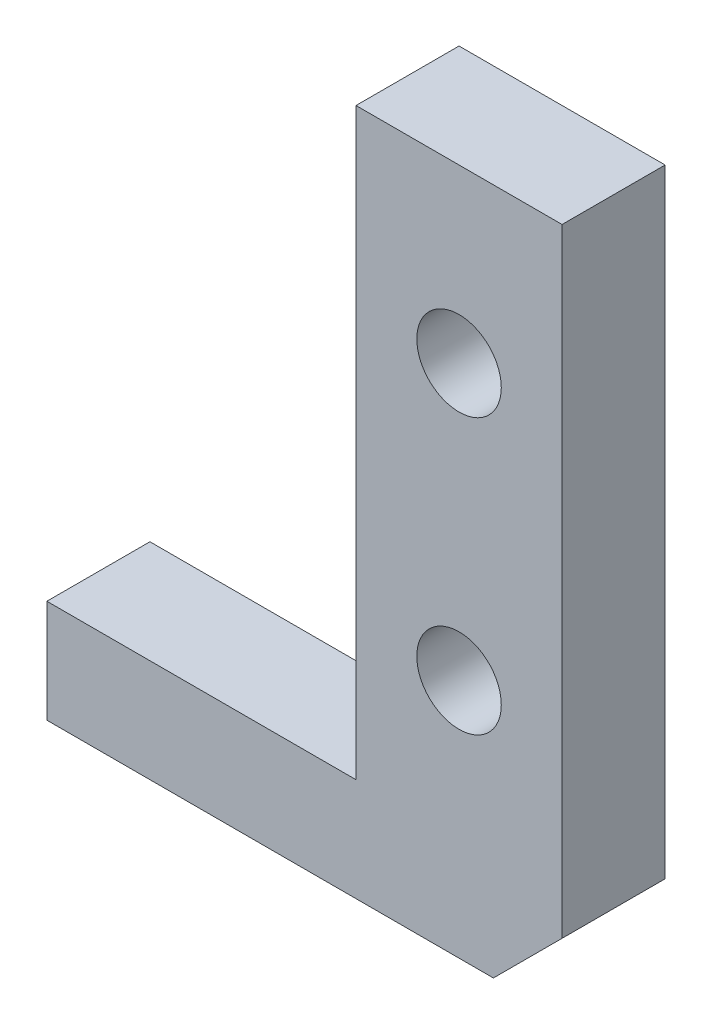
ISO-10303-21;
HEADER;
FILE_DESCRIPTION(('STEP AP214'),'2;1');
FILE_NAME('part.step','',(''),(''),'','','');
FILE_SCHEMA(('AUTOMOTIVE_DESIGN { 1 0 10303 214 1 1 1 1 }'));
ENDSEC;
DATA;
#1=APPLICATION_CONTEXT('core data for automotive mechanical design processes');
#2=APPLICATION_PROTOCOL_DEFINITION('international standard','automotive_design',2000,#1);
#3=PRODUCT_CONTEXT('',#1,'mechanical');
#4=PRODUCT('Part','Part','',(#3));
#5=PRODUCT_RELATED_PRODUCT_CATEGORY('part','',(#4));
#6=PRODUCT_DEFINITION_FORMATION('','',#4);
#7=PRODUCT_DEFINITION_CONTEXT('part definition',#1,'design');
#8=PRODUCT_DEFINITION('design','',#6,#7);
#9=PRODUCT_DEFINITION_SHAPE('','',#8);
#10=(LENGTH_UNIT() NAMED_UNIT(*) SI_UNIT(.MILLI.,.METRE.));
#11=(NAMED_UNIT(*) PLANE_ANGLE_UNIT() SI_UNIT($,.RADIAN.));
#12=(NAMED_UNIT(*) SI_UNIT($,.STERADIAN.) SOLID_ANGLE_UNIT());
#13=UNCERTAINTY_MEASURE_WITH_UNIT(LENGTH_MEASURE(1.E-05),#10,'distance_accuracy_value','');
#14=(GEOMETRIC_REPRESENTATION_CONTEXT(3) GLOBAL_UNCERTAINTY_ASSIGNED_CONTEXT((#13)) GLOBAL_UNIT_ASSIGNED_CONTEXT((#10,
#11,#12)) REPRESENTATION_CONTEXT('',''));
#15=CARTESIAN_POINT('',(0.,0.,0.));
#16=DIRECTION('',(0.,0.,1.));
#17=DIRECTION('',(1.,0.,0.));
#18=AXIS2_PLACEMENT_3D('',#15,#16,#17);
#19=CARTESIAN_POINT('',(0.,3.,3.));
#20=DIRECTION('',(1.,0.,0.));
#21=DIRECTION('',(0.,1.,0.));
#22=AXIS2_PLACEMENT_3D('',#19,#20,#21);
#23=PLANE('',#22);
#24=DIRECTION('',(0.,-1.,0.));
#25=VECTOR('',#24,1.);
#26=CARTESIAN_POINT('',(0.,3.,0.));
#27=LINE('',#26,#25);
#28=CARTESIAN_POINT('',(0.,3.,0.));
#29=VERTEX_POINT('',#28);
#30=CARTESIAN_POINT('',(0.,0.,0.));
#31=VERTEX_POINT('',#30);
#32=EDGE_CURVE('E123',#29,#31,#27,.T.);
#33=ORIENTED_EDGE('',*,*,#32,.T.);
#34=DIRECTION('',(0.,0.,-1.));
#35=VECTOR('',#34,1.);
#36=CARTESIAN_POINT('',(0.,0.,3.));
#37=LINE('',#36,#35);
#38=CARTESIAN_POINT('',(0.,0.,3.));
#39=VERTEX_POINT('',#38);
#40=EDGE_CURVE('E11',#39,#31,#37,.T.);
#41=ORIENTED_EDGE('',*,*,#40,.F.);
#42=DIRECTION('',(0.,-1.,0.));
#43=VECTOR('',#42,1.);
#44=CARTESIAN_POINT('',(0.,3.,3.));
#45=LINE('',#44,#43);
#46=CARTESIAN_POINT('',(0.,3.,3.));
#47=VERTEX_POINT('',#46);
#48=EDGE_CURVE('E136',#47,#39,#45,.T.);
#49=ORIENTED_EDGE('',*,*,#48,.F.);
#50=DIRECTION('',(0.,0.,-1.));
#51=VECTOR('',#50,1.);
#52=CARTESIAN_POINT('',(0.,3.,3.));
#53=LINE('',#52,#51);
#54=EDGE_CURVE('E119',#47,#29,#53,.T.);
#55=ORIENTED_EDGE('',*,*,#54,.T.);
#56=EDGE_LOOP('',(#33,#41,#49,#55));
#57=FACE_BOUND('',#56,.T.);
#58=ADVANCED_FACE('F33',(#57),#23,.F.);
#59=CARTESIAN_POINT('',(0.,0.,3.));
#60=DIRECTION('',(0.,1.,0.));
#61=DIRECTION('',(-1.,0.,0.));
#62=AXIS2_PLACEMENT_3D('',#59,#60,#61);
#63=PLANE('',#62);
#64=DIRECTION('',(1.,0.,0.));
#65=VECTOR('',#64,1.);
#66=CARTESIAN_POINT('',(0.,0.,0.));
#67=LINE('',#66,#65);
#68=CARTESIAN_POINT('',(13.,0.,0.));
#69=VERTEX_POINT('',#68);
#70=EDGE_CURVE('E126',#31,#69,#67,.T.);
#71=ORIENTED_EDGE('',*,*,#70,.T.);
#72=DIRECTION('',(0.,0.,-1.));
#73=VECTOR('',#72,1.);
#74=CARTESIAN_POINT('',(13.,0.,3.));
#75=LINE('',#74,#73);
#76=CARTESIAN_POINT('',(13.,0.,3.));
#77=VERTEX_POINT('',#76);
#78=EDGE_CURVE('E41',#77,#69,#75,.T.);
#79=ORIENTED_EDGE('',*,*,#78,.F.);
#80=DIRECTION('',(1.,0.,0.));
#81=VECTOR('',#80,1.);
#82=CARTESIAN_POINT('',(0.,0.,3.));
#83=LINE('',#82,#81);
#84=EDGE_CURVE('E89',#39,#77,#83,.T.);
#85=ORIENTED_EDGE('',*,*,#84,.F.);
#86=ORIENTED_EDGE('',*,*,#40,.T.);
#87=EDGE_LOOP('',(#71,#79,#85,#86));
#88=FACE_BOUND('',#87,.T.);
#89=ADVANCED_FACE('F195',(#88),#63,.F.);
#90=CARTESIAN_POINT('',(13.,0.,3.));
#91=DIRECTION('',(-0.707106781186549,0.707106781186546,0.));
#92=DIRECTION('',(-0.707106781186546,-0.707106781186549,0.));
#93=AXIS2_PLACEMENT_3D('',#90,#91,#92);
#94=PLANE('',#93);
#95=DIRECTION('',(0.707106781186546,0.707106781186549,0.));
#96=VECTOR('',#95,1.);
#97=CARTESIAN_POINT('',(13.,0.,0.));
#98=LINE('',#97,#96);
#99=CARTESIAN_POINT('',(15.,2.00000000000001,0.));
#100=VERTEX_POINT('',#99);
#101=EDGE_CURVE('E129',#69,#100,#98,.T.);
#102=ORIENTED_EDGE('',*,*,#101,.T.);
#103=DIRECTION('',(0.,0.,-1.));
#104=VECTOR('',#103,1.);
#105=CARTESIAN_POINT('',(15.,2.00000000000001,3.));
#106=LINE('',#105,#104);
#107=CARTESIAN_POINT('',(15.,2.00000000000001,3.));
#108=VERTEX_POINT('',#107);
#109=EDGE_CURVE('E140',#108,#100,#106,.T.);
#110=ORIENTED_EDGE('',*,*,#109,.F.);
#111=DIRECTION('',(0.707106781186546,0.707106781186549,0.));
#112=VECTOR('',#111,1.);
#113=CARTESIAN_POINT('',(13.,0.,3.));
#114=LINE('',#113,#112);
#115=EDGE_CURVE('E148',#77,#108,#114,.T.);
#116=ORIENTED_EDGE('',*,*,#115,.F.);
#117=ORIENTED_EDGE('',*,*,#78,.T.);
#118=EDGE_LOOP('',(#102,#110,#116,#117));
#119=FACE_BOUND('',#118,.T.);
#120=ADVANCED_FACE('F146',(#119),#94,.F.);
#121=CARTESIAN_POINT('',(15.,2.00000000000001,3.));
#122=DIRECTION('',(-1.,0.,0.));
#123=DIRECTION('',(0.,-1.,0.));
#124=AXIS2_PLACEMENT_3D('',#121,#122,#123);
#125=PLANE('',#124);
#126=DIRECTION('',(0.,1.,0.));
#127=VECTOR('',#126,1.);
#128=CARTESIAN_POINT('',(15.,2.00000000000001,0.));
#129=LINE('',#128,#127);
#130=CARTESIAN_POINT('',(15.,20.,0.));
#131=VERTEX_POINT('',#130);
#132=EDGE_CURVE('E131',#100,#131,#129,.T.);
#133=ORIENTED_EDGE('',*,*,#132,.T.);
#134=DIRECTION('',(0.,0.,-1.));
#135=VECTOR('',#134,1.);
#136=CARTESIAN_POINT('',(15.,20.,3.));
#137=LINE('',#136,#135);
#138=CARTESIAN_POINT('',(15.,20.,3.));
#139=VERTEX_POINT('',#138);
#140=EDGE_CURVE('E114',#139,#131,#137,.T.);
#141=ORIENTED_EDGE('',*,*,#140,.F.);
#142=DIRECTION('',(0.,1.,0.));
#143=VECTOR('',#142,1.);
#144=CARTESIAN_POINT('',(15.,2.00000000000001,3.));
#145=LINE('',#144,#143);
#146=EDGE_CURVE('E105',#108,#139,#145,.T.);
#147=ORIENTED_EDGE('',*,*,#146,.F.);
#148=ORIENTED_EDGE('',*,*,#109,.T.);
#149=EDGE_LOOP('',(#133,#141,#147,#148));
#150=FACE_BOUND('',#149,.T.);
#151=ADVANCED_FACE('F154',(#150),#125,.F.);
#152=CARTESIAN_POINT('',(15.,20.,3.));
#153=DIRECTION('',(0.,-1.,0.));
#154=DIRECTION('',(1.,0.,0.));
#155=AXIS2_PLACEMENT_3D('',#152,#153,#154);
#156=PLANE('',#155);
#157=DIRECTION('',(-1.,0.,0.));
#158=VECTOR('',#157,1.);
#159=CARTESIAN_POINT('',(15.,20.,0.));
#160=LINE('',#159,#158);
#161=CARTESIAN_POINT('',(9.,20.,0.));
#162=VERTEX_POINT('',#161);
#163=EDGE_CURVE('E113',#131,#162,#160,.T.);
#164=ORIENTED_EDGE('',*,*,#163,.T.);
#165=DIRECTION('',(0.,0.,-1.));
#166=VECTOR('',#165,1.);
#167=CARTESIAN_POINT('',(9.,20.,3.));
#168=LINE('',#167,#166);
#169=CARTESIAN_POINT('',(9.,20.,3.));
#170=VERTEX_POINT('',#169);
#171=EDGE_CURVE('E110',#170,#162,#168,.T.);
#172=ORIENTED_EDGE('',*,*,#171,.F.);
#173=DIRECTION('',(-1.,0.,0.));
#174=VECTOR('',#173,1.);
#175=CARTESIAN_POINT('',(15.,20.,3.));
#176=LINE('',#175,#174);
#177=EDGE_CURVE('E99',#139,#170,#176,.T.);
#178=ORIENTED_EDGE('',*,*,#177,.F.);
#179=ORIENTED_EDGE('',*,*,#140,.T.);
#180=EDGE_LOOP('',(#164,#172,#178,#179));
#181=FACE_BOUND('',#180,.T.);
#182=ADVANCED_FACE('F111',(#181),#156,.F.);
#183=CARTESIAN_POINT('',(9.,20.,3.));
#184=DIRECTION('',(1.,0.,0.));
#185=DIRECTION('',(0.,1.,0.));
#186=AXIS2_PLACEMENT_3D('',#183,#184,#185);
#187=PLANE('',#186);
#188=DIRECTION('',(0.,-1.,0.));
#189=VECTOR('',#188,1.);
#190=CARTESIAN_POINT('',(9.,20.,0.));
#191=LINE('',#190,#189);
#192=CARTESIAN_POINT('',(9.,3.,0.));
#193=VERTEX_POINT('',#192);
#194=EDGE_CURVE('E75',#162,#193,#191,.T.);
#195=ORIENTED_EDGE('',*,*,#194,.T.);
#196=DIRECTION('',(0.,0.,-1.));
#197=VECTOR('',#196,1.);
#198=CARTESIAN_POINT('',(9.,3.,3.));
#199=LINE('',#198,#197);
#200=CARTESIAN_POINT('',(9.,3.,3.));
#201=VERTEX_POINT('',#200);
#202=EDGE_CURVE('E115',#201,#193,#199,.T.);
#203=ORIENTED_EDGE('',*,*,#202,.F.);
#204=DIRECTION('',(0.,-1.,0.));
#205=VECTOR('',#204,1.);
#206=CARTESIAN_POINT('',(9.,20.,3.));
#207=LINE('',#206,#205);
#208=EDGE_CURVE('E103',#170,#201,#207,.T.);
#209=ORIENTED_EDGE('',*,*,#208,.F.);
#210=ORIENTED_EDGE('',*,*,#171,.T.);
#211=EDGE_LOOP('',(#195,#203,#209,#210));
#212=FACE_BOUND('',#211,.T.);
#213=ADVANCED_FACE('F117',(#212),#187,.F.);
#214=CARTESIAN_POINT('',(9.,3.,3.));
#215=DIRECTION('',(0.,-1.,0.));
#216=DIRECTION('',(1.,0.,0.));
#217=AXIS2_PLACEMENT_3D('',#214,#215,#216);
#218=PLANE('',#217);
#219=DIRECTION('',(-1.,0.,0.));
#220=VECTOR('',#219,1.);
#221=CARTESIAN_POINT('',(9.,3.,0.));
#222=LINE('',#221,#220);
#223=EDGE_CURVE('E81',#193,#29,#222,.T.);
#224=ORIENTED_EDGE('',*,*,#223,.T.);
#225=ORIENTED_EDGE('',*,*,#54,.F.);
#226=DIRECTION('',(-1.,0.,0.));
#227=VECTOR('',#226,1.);
#228=CARTESIAN_POINT('',(9.,3.,3.));
#229=LINE('',#228,#227);
#230=EDGE_CURVE('E49',#201,#47,#229,.T.);
#231=ORIENTED_EDGE('',*,*,#230,.F.);
#232=ORIENTED_EDGE('',*,*,#202,.T.);
#233=EDGE_LOOP('',(#224,#225,#231,#232));
#234=FACE_BOUND('',#233,.T.);
#235=ADVANCED_FACE('F182',(#234),#218,.F.);
#236=CARTESIAN_POINT('',(0.,0.,3.));
#237=DIRECTION('',(0.,0.,1.));
#238=DIRECTION('',(1.,0.,0.));
#239=AXIS2_PLACEMENT_3D('',#236,#237,#238);
#240=PLANE('',#239);
#241=CARTESIAN_POINT('',(12.,15.,3.));
#242=DIRECTION('',(0.,0.,1.));
#243=DIRECTION('',(1.,0.,0.));
#244=AXIS2_PLACEMENT_3D('',#241,#242,#243);
#245=CIRCLE('',#244,1.23);
#246=CARTESIAN_POINT('',(13.23,15.,3.));
#247=VERTEX_POINT('',#246);
#248=EDGE_CURVE('E165',#247,#247,#245,.T.);
#249=ORIENTED_EDGE('',*,*,#248,.F.);
#250=EDGE_LOOP('',(#249));
#251=FACE_BOUND('',#250,.T.);
#252=CARTESIAN_POINT('',(12.,7.,3.));
#253=DIRECTION('',(0.,0.,1.));
#254=DIRECTION('',(1.,0.,0.));
#255=AXIS2_PLACEMENT_3D('',#252,#253,#254);
#256=CIRCLE('',#255,1.23);
#257=CARTESIAN_POINT('',(13.23,7.,3.));
#258=VERTEX_POINT('',#257);
#259=EDGE_CURVE('E159',#258,#258,#256,.T.);
#260=ORIENTED_EDGE('',*,*,#259,.F.);
#261=EDGE_LOOP('',(#260));
#262=FACE_BOUND('',#261,.T.);
#263=ORIENTED_EDGE('',*,*,#48,.T.);
#264=ORIENTED_EDGE('',*,*,#84,.T.);
#265=ORIENTED_EDGE('',*,*,#115,.T.);
#266=ORIENTED_EDGE('',*,*,#146,.T.);
#267=ORIENTED_EDGE('',*,*,#177,.T.);
#268=ORIENTED_EDGE('',*,*,#208,.T.);
#269=ORIENTED_EDGE('',*,*,#230,.T.);
#270=EDGE_LOOP('',(#263,#264,#265,#266,#267,#268,#269));
#271=FACE_BOUND('',#270,.T.);
#272=ADVANCED_FACE('F101',(#251,#262,#271),#240,.T.);
#273=CARTESIAN_POINT('',(0.,0.,0.));
#274=DIRECTION('',(0.,0.,1.));
#275=DIRECTION('',(1.,0.,0.));
#276=AXIS2_PLACEMENT_3D('',#273,#274,#275);
#277=PLANE('',#276);
#278=CARTESIAN_POINT('',(12.,15.,0.));
#279=DIRECTION('',(0.,0.,1.));
#280=DIRECTION('',(1.,0.,0.));
#281=AXIS2_PLACEMENT_3D('',#278,#279,#280);
#282=CIRCLE('',#281,1.23);
#283=CARTESIAN_POINT('',(13.23,15.,0.));
#284=VERTEX_POINT('',#283);
#285=EDGE_CURVE('E127',#284,#284,#282,.T.);
#286=ORIENTED_EDGE('',*,*,#285,.T.);
#287=EDGE_LOOP('',(#286));
#288=FACE_BOUND('',#287,.T.);
#289=CARTESIAN_POINT('',(12.,7.,0.));
#290=DIRECTION('',(0.,0.,1.));
#291=DIRECTION('',(1.,0.,0.));
#292=AXIS2_PLACEMENT_3D('',#289,#290,#291);
#293=CIRCLE('',#292,1.23);
#294=CARTESIAN_POINT('',(13.23,7.,0.));
#295=VERTEX_POINT('',#294);
#296=EDGE_CURVE('E162',#295,#295,#293,.T.);
#297=ORIENTED_EDGE('',*,*,#296,.T.);
#298=EDGE_LOOP('',(#297));
#299=FACE_BOUND('',#298,.T.);
#300=ORIENTED_EDGE('',*,*,#32,.F.);
#301=ORIENTED_EDGE('',*,*,#223,.F.);
#302=ORIENTED_EDGE('',*,*,#194,.F.);
#303=ORIENTED_EDGE('',*,*,#163,.F.);
#304=ORIENTED_EDGE('',*,*,#132,.F.);
#305=ORIENTED_EDGE('',*,*,#101,.F.);
#306=ORIENTED_EDGE('',*,*,#70,.F.);
#307=EDGE_LOOP('',(#300,#301,#302,#303,#304,#305,#306));
#308=FACE_BOUND('',#307,.T.);
#309=ADVANCED_FACE('F152',(#288,#299,#308),#277,.F.);
#310=CARTESIAN_POINT('',(12.,7.,0.));
#311=DIRECTION('',(0.,0.,1.));
#312=DIRECTION('',(1.,0.,0.));
#313=AXIS2_PLACEMENT_3D('',#310,#311,#312);
#314=CYLINDRICAL_SURFACE('',#313,1.23);
#315=ORIENTED_EDGE('',*,*,#296,.F.);
#316=EDGE_LOOP('',(#315));
#317=FACE_BOUND('',#316,.T.);
#318=ORIENTED_EDGE('',*,*,#259,.T.);
#319=EDGE_LOOP('',(#318));
#320=FACE_BOUND('',#319,.T.);
#321=ADVANCED_FACE('F176',(#317,#320),#314,.F.);
#322=CARTESIAN_POINT('',(12.,15.,0.));
#323=DIRECTION('',(0.,0.,1.));
#324=DIRECTION('',(1.,0.,0.));
#325=AXIS2_PLACEMENT_3D('',#322,#323,#324);
#326=CYLINDRICAL_SURFACE('',#325,1.23);
#327=ORIENTED_EDGE('',*,*,#285,.F.);
#328=EDGE_LOOP('',(#327));
#329=FACE_BOUND('',#328,.T.);
#330=ORIENTED_EDGE('',*,*,#248,.T.);
#331=EDGE_LOOP('',(#330));
#332=FACE_BOUND('',#331,.T.);
#333=ADVANCED_FACE('F173',(#329,#332),#326,.F.);
#334=CLOSED_SHELL('',(#58,#89,#120,#151,#182,#213,#235,#272,#309,#321,#333));
#335=MANIFOLD_SOLID_BREP('B2',#334);
#336=ADVANCED_BREP_SHAPE_REPRESENTATION('',(#18,#335),#14);
#337=SHAPE_DEFINITION_REPRESENTATION(#9,#336);
ENDSEC;
END-ISO-10303-21;
